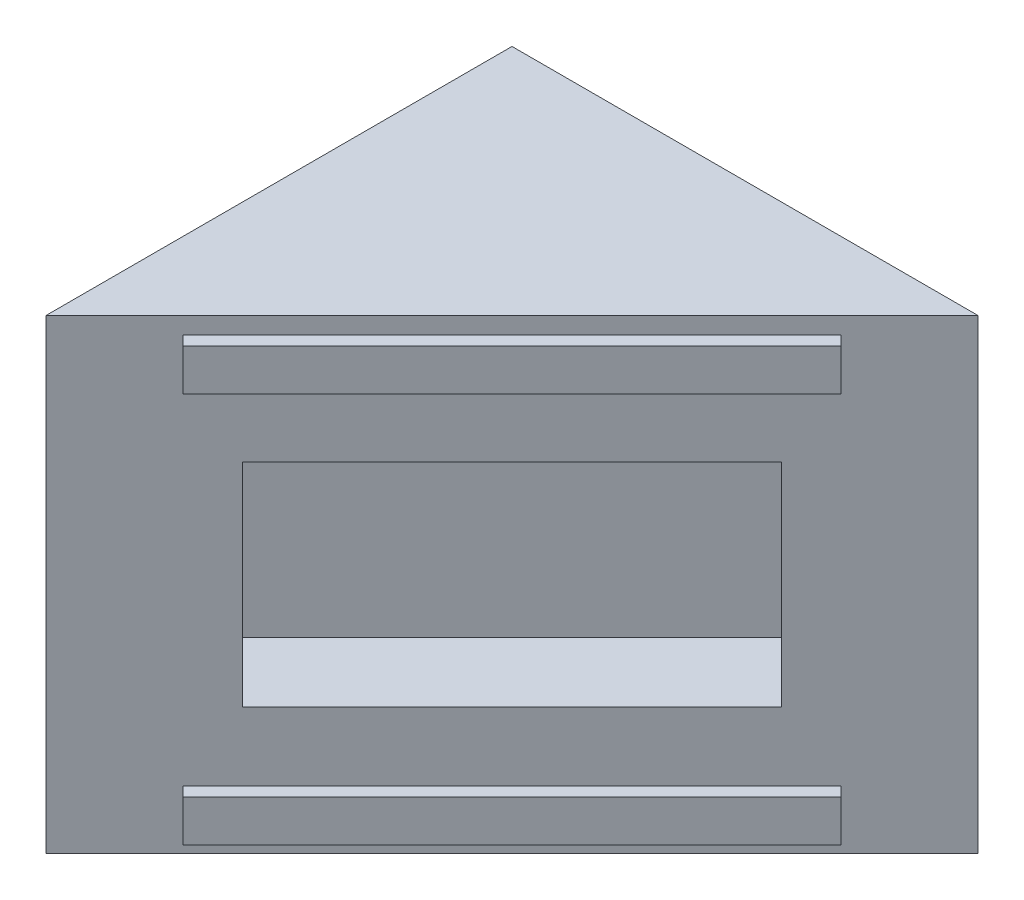
ISO-10303-21;
HEADER;
FILE_DESCRIPTION(('STEP AP214'),'2;1');
FILE_NAME('part.step','',(''),(''),'','','');
FILE_SCHEMA(('AUTOMOTIVE_DESIGN { 1 0 10303 214 1 1 1 1 }'));
ENDSEC;
DATA;
#1=APPLICATION_CONTEXT('core data for automotive mechanical design processes');
#2=APPLICATION_PROTOCOL_DEFINITION('international standard','automotive_design',2000,#1);
#3=PRODUCT_CONTEXT('',#1,'mechanical');
#4=PRODUCT('Part','Part','',(#3));
#5=PRODUCT_RELATED_PRODUCT_CATEGORY('part','',(#4));
#6=PRODUCT_DEFINITION_FORMATION('','',#4);
#7=PRODUCT_DEFINITION_CONTEXT('part definition',#1,'design');
#8=PRODUCT_DEFINITION('design','',#6,#7);
#9=PRODUCT_DEFINITION_SHAPE('','',#8);
#10=(LENGTH_UNIT() NAMED_UNIT(*) SI_UNIT(.MILLI.,.METRE.));
#11=(NAMED_UNIT(*) PLANE_ANGLE_UNIT() SI_UNIT($,.RADIAN.));
#12=(NAMED_UNIT(*) SI_UNIT($,.STERADIAN.) SOLID_ANGLE_UNIT());
#13=UNCERTAINTY_MEASURE_WITH_UNIT(LENGTH_MEASURE(1.E-05),#10,'distance_accuracy_value','');
#14=(GEOMETRIC_REPRESENTATION_CONTEXT(3) GLOBAL_UNCERTAINTY_ASSIGNED_CONTEXT((#13)) GLOBAL_UNIT_ASSIGNED_CONTEXT((#10,
#11,#12)) REPRESENTATION_CONTEXT('',''));
#15=CARTESIAN_POINT('',(0.,0.,0.));
#16=DIRECTION('',(0.,0.,1.));
#17=DIRECTION('',(1.,0.,0.));
#18=AXIS2_PLACEMENT_3D('',#15,#16,#17);
#19=CARTESIAN_POINT('',(0.,0.,0.));
#20=DIRECTION('',(0.707106781186547,0.,0.707106781186548));
#21=DIRECTION('',(0.707106781186548,0.,-0.707106781186547));
#22=AXIS2_PLACEMENT_3D('',#19,#20,#21);
#23=PLANE('',#22);
#24=DIRECTION('',(0.,1.,0.));
#25=VECTOR('',#24,1.);
#26=CARTESIAN_POINT('',(55.1305762724056,19.05,-55.1305762724056));
#27=LINE('',#26,#25);
#28=CARTESIAN_POINT('',(55.1305762724056,19.05,-55.1305762724056));
#29=VERTEX_POINT('',#28);
#30=CARTESIAN_POINT('',(55.1305762724056,50.8,-55.1305762724056));
#31=VERTEX_POINT('',#30);
#32=EDGE_CURVE('E59',#29,#31,#27,.T.);
#33=ORIENTED_EDGE('',*,*,#32,.F.);
#34=DIRECTION('',(0.707106781186547,0.,-0.707106781186548));
#35=VECTOR('',#34,1.);
#36=CARTESIAN_POINT('',(14.7194237275944,19.05,-14.7194237275944));
#37=LINE('',#36,#35);
#38=CARTESIAN_POINT('',(14.7194237275944,19.05,-14.7194237275944));
#39=VERTEX_POINT('',#38);
#40=EDGE_CURVE('E174',#39,#29,#37,.T.);
#41=ORIENTED_EDGE('',*,*,#40,.F.);
#42=DIRECTION('',(0.,-1.,0.));
#43=VECTOR('',#42,1.);
#44=CARTESIAN_POINT('',(14.7194237275944,19.05,-14.7194237275944));
#45=LINE('',#44,#43);
#46=CARTESIAN_POINT('',(14.7194237275944,50.8,-14.7194237275944));
#47=VERTEX_POINT('',#46);
#48=EDGE_CURVE('E178',#47,#39,#45,.T.);
#49=ORIENTED_EDGE('',*,*,#48,.F.);
#50=DIRECTION('',(-0.707106781186547,0.,0.707106781186548));
#51=VECTOR('',#50,1.);
#52=CARTESIAN_POINT('',(14.7194237275944,50.8,-14.7194237275944));
#53=LINE('',#52,#51);
#54=EDGE_CURVE('E187',#31,#47,#53,.T.);
#55=ORIENTED_EDGE('',*,*,#54,.F.);
#56=EDGE_LOOP('',(#33,#41,#49,#55));
#57=FACE_BOUND('',#56,.T.);
#58=DIRECTION('',(-0.707106781186548,0.,0.707106781186547));
#59=VECTOR('',#58,1.);
#60=CARTESIAN_POINT('',(34.925,69.85,-34.925));
#61=LINE('',#60,#59);
#62=CARTESIAN_POINT('',(69.85,69.85,-69.85));
#63=VERTEX_POINT('',#62);
#64=CARTESIAN_POINT('',(0.,69.85,0.));
#65=VERTEX_POINT('',#64);
#66=EDGE_CURVE('E281',#63,#65,#61,.T.);
#67=ORIENTED_EDGE('',*,*,#66,.T.);
#68=DIRECTION('',(0.,-1.,0.));
#69=VECTOR('',#68,1.);
#70=CARTESIAN_POINT('',(0.,69.85,0.));
#71=LINE('',#70,#69);
#72=CARTESIAN_POINT('',(0.,0.,0.));
#73=VERTEX_POINT('',#72);
#74=EDGE_CURVE('E11',#65,#73,#71,.T.);
#75=ORIENTED_EDGE('',*,*,#74,.T.);
#76=DIRECTION('',(0.707106781186548,0.,-0.707106781186547));
#77=VECTOR('',#76,1.);
#78=CARTESIAN_POINT('',(69.85,0.,-69.85));
#79=LINE('',#78,#77);
#80=CARTESIAN_POINT('',(69.85,0.,-69.85));
#81=VERTEX_POINT('',#80);
#82=EDGE_CURVE('E284',#73,#81,#79,.T.);
#83=ORIENTED_EDGE('',*,*,#82,.T.);
#84=DIRECTION('',(0.,-1.,0.));
#85=VECTOR('',#84,1.);
#86=CARTESIAN_POINT('',(69.85,69.85,-69.85));
#87=LINE('',#86,#85);
#88=EDGE_CURVE('E52',#63,#81,#87,.T.);
#89=ORIENTED_EDGE('',*,*,#88,.F.);
#90=EDGE_LOOP('',(#67,#75,#83,#89));
#91=FACE_BOUND('',#90,.T.);
#92=DIRECTION('',(0.707106781186547,0.,-0.707106781186548));
#93=VECTOR('',#92,1.);
#94=CARTESIAN_POINT('',(10.2741969476652,61.087,-10.2741969476652));
#95=LINE('',#94,#93);
#96=CARTESIAN_POINT('',(10.2741969476652,61.087,-10.2741969476652));
#97=VERTEX_POINT('',#96);
#98=CARTESIAN_POINT('',(59.5758030523348,61.087,-59.5758030523348));
#99=VERTEX_POINT('',#98);
#100=EDGE_CURVE('E259',#97,#99,#95,.T.);
#101=ORIENTED_EDGE('',*,*,#100,.F.);
#102=DIRECTION('',(0.,-1.,0.));
#103=VECTOR('',#102,1.);
#104=CARTESIAN_POINT('',(10.2741969476652,67.31,-10.2741969476652));
#105=LINE('',#104,#103);
#106=CARTESIAN_POINT('',(10.2741969476652,67.31,-10.2741969476652));
#107=VERTEX_POINT('',#106);
#108=EDGE_CURVE('E229',#107,#97,#105,.T.);
#109=ORIENTED_EDGE('',*,*,#108,.F.);
#110=DIRECTION('',(-0.707106781186547,0.,0.707106781186548));
#111=VECTOR('',#110,1.);
#112=CARTESIAN_POINT('',(10.2741969476652,67.31,-10.2741969476652));
#113=LINE('',#112,#111);
#114=CARTESIAN_POINT('',(59.5758030523348,67.31,-59.5758030523348));
#115=VERTEX_POINT('',#114);
#116=EDGE_CURVE('E246',#115,#107,#113,.T.);
#117=ORIENTED_EDGE('',*,*,#116,.F.);
#118=DIRECTION('',(0.,1.,0.));
#119=VECTOR('',#118,1.);
#120=CARTESIAN_POINT('',(59.5758030523348,67.31,-59.5758030523348));
#121=LINE('',#120,#119);
#122=EDGE_CURVE('E262',#99,#115,#121,.T.);
#123=ORIENTED_EDGE('',*,*,#122,.F.);
#124=EDGE_LOOP('',(#101,#109,#117,#123));
#125=FACE_BOUND('',#124,.T.);
#126=DIRECTION('',(0.707106781186547,0.,-0.707106781186548));
#127=VECTOR('',#126,1.);
#128=CARTESIAN_POINT('',(10.2741969476652,2.54,-10.2741969476652));
#129=LINE('',#128,#127);
#130=CARTESIAN_POINT('',(10.2741969476652,2.54,-10.2741969476652));
#131=VERTEX_POINT('',#130);
#132=CARTESIAN_POINT('',(59.5758030523348,2.54,-59.5758030523348));
#133=VERTEX_POINT('',#132);
#134=EDGE_CURVE('E222',#131,#133,#129,.T.);
#135=ORIENTED_EDGE('',*,*,#134,.F.);
#136=DIRECTION('',(0.,-1.,0.));
#137=VECTOR('',#136,1.);
#138=CARTESIAN_POINT('',(10.2741969476652,8.763,-10.2741969476652));
#139=LINE('',#138,#137);
#140=CARTESIAN_POINT('',(10.2741969476652,8.763,-10.2741969476652));
#141=VERTEX_POINT('',#140);
#142=EDGE_CURVE('E225',#141,#131,#139,.T.);
#143=ORIENTED_EDGE('',*,*,#142,.F.);
#144=DIRECTION('',(-0.707106781186547,0.,0.707106781186548));
#145=VECTOR('',#144,1.);
#146=CARTESIAN_POINT('',(10.2741969476652,8.763,-10.2741969476652));
#147=LINE('',#146,#145);
#148=CARTESIAN_POINT('',(59.5758030523348,8.763,-59.5758030523348));
#149=VERTEX_POINT('',#148);
#150=EDGE_CURVE('E215',#149,#141,#147,.T.);
#151=ORIENTED_EDGE('',*,*,#150,.F.);
#152=DIRECTION('',(0.,1.,0.));
#153=VECTOR('',#152,1.);
#154=CARTESIAN_POINT('',(59.5758030523348,8.763,-59.5758030523348));
#155=LINE('',#154,#153);
#156=EDGE_CURVE('E218',#133,#149,#155,.T.);
#157=ORIENTED_EDGE('',*,*,#156,.F.);
#158=EDGE_LOOP('',(#135,#143,#151,#157));
#159=FACE_BOUND('',#158,.T.);
#160=ADVANCED_FACE('F43',(#57,#91,#125,#159),#23,.T.);
#161=CARTESIAN_POINT('',(0.,69.85,0.));
#162=DIRECTION('',(0.,-1.,0.));
#163=DIRECTION('',(0.,0.,-1.));
#164=AXIS2_PLACEMENT_3D('',#161,#162,#163);
#165=PLANE('',#164);
#166=ORIENTED_EDGE('',*,*,#66,.F.);
#167=DIRECTION('',(-1.,0.,0.));
#168=VECTOR('',#167,1.);
#169=CARTESIAN_POINT('',(0.,69.85,-69.85));
#170=LINE('',#169,#168);
#171=CARTESIAN_POINT('',(0.,69.85,-69.85));
#172=VERTEX_POINT('',#171);
#173=EDGE_CURVE('E292',#63,#172,#170,.T.);
#174=ORIENTED_EDGE('',*,*,#173,.T.);
#175=DIRECTION('',(0.,0.,1.));
#176=VECTOR('',#175,1.);
#177=CARTESIAN_POINT('',(0.,69.85,0.));
#178=LINE('',#177,#176);
#179=EDGE_CURVE('E288',#172,#65,#178,.T.);
#180=ORIENTED_EDGE('',*,*,#179,.T.);
#181=EDGE_LOOP('',(#166,#174,#180));
#182=FACE_BOUND('',#181,.T.);
#183=ADVANCED_FACE('F321',(#182),#165,.F.);
#184=CARTESIAN_POINT('',(0.,0.,0.));
#185=DIRECTION('',(0.,-1.,0.));
#186=DIRECTION('',(0.,0.,-1.));
#187=AXIS2_PLACEMENT_3D('',#184,#185,#186);
#188=PLANE('',#187);
#189=DIRECTION('',(-1.,0.,0.));
#190=VECTOR('',#189,1.);
#191=CARTESIAN_POINT('',(0.,0.,-69.85));
#192=LINE('',#191,#190);
#193=CARTESIAN_POINT('',(0.,0.,-69.85));
#194=VERTEX_POINT('',#193);
#195=EDGE_CURVE('E293',#81,#194,#192,.T.);
#196=ORIENTED_EDGE('',*,*,#195,.F.);
#197=ORIENTED_EDGE('',*,*,#82,.F.);
#198=DIRECTION('',(0.,0.,1.));
#199=VECTOR('',#198,1.);
#200=CARTESIAN_POINT('',(0.,0.,0.));
#201=LINE('',#200,#199);
#202=EDGE_CURVE('E287',#194,#73,#201,.T.);
#203=ORIENTED_EDGE('',*,*,#202,.F.);
#204=EDGE_LOOP('',(#196,#197,#203));
#205=FACE_BOUND('',#204,.T.);
#206=ADVANCED_FACE('F316',(#205),#188,.T.);
#207=CARTESIAN_POINT('',(0.,69.85,0.));
#208=DIRECTION('',(1.,0.,0.));
#209=DIRECTION('',(0.,0.,-1.));
#210=AXIS2_PLACEMENT_3D('',#207,#208,#209);
#211=PLANE('',#210);
#212=ORIENTED_EDGE('',*,*,#202,.T.);
#213=ORIENTED_EDGE('',*,*,#74,.F.);
#214=ORIENTED_EDGE('',*,*,#179,.F.);
#215=DIRECTION('',(0.,-1.,0.));
#216=VECTOR('',#215,1.);
#217=CARTESIAN_POINT('',(0.,69.85,-69.85));
#218=LINE('',#217,#216);
#219=EDGE_CURVE('E296',#172,#194,#218,.T.);
#220=ORIENTED_EDGE('',*,*,#219,.T.);
#221=EDGE_LOOP('',(#212,#213,#214,#220));
#222=FACE_BOUND('',#221,.T.);
#223=ADVANCED_FACE('F45',(#222),#211,.F.);
#224=CARTESIAN_POINT('',(0.,69.85,-69.85));
#225=DIRECTION('',(0.,0.,1.));
#226=DIRECTION('',(1.,0.,0.));
#227=AXIS2_PLACEMENT_3D('',#224,#225,#226);
#228=PLANE('',#227);
#229=ORIENTED_EDGE('',*,*,#195,.T.);
#230=ORIENTED_EDGE('',*,*,#219,.F.);
#231=ORIENTED_EDGE('',*,*,#173,.F.);
#232=ORIENTED_EDGE('',*,*,#88,.T.);
#233=EDGE_LOOP('',(#229,#230,#231,#232));
#234=FACE_BOUND('',#233,.T.);
#235=ADVANCED_FACE('F309',(#234),#228,.F.);
#236=CARTESIAN_POINT('',(11.7110379270362,67.31,-8.83735596829409));
#237=DIRECTION('',(0.707106781186547,0.,-0.707106781186548));
#238=DIRECTION('',(-0.707106781186548,0.,-0.707106781186547));
#239=AXIS2_PLACEMENT_3D('',#236,#237,#238);
#240=PLANE('',#239);
#241=ORIENTED_EDGE('',*,*,#108,.T.);
#242=DIRECTION('',(-0.707106781186548,0.,-0.707106781186547));
#243=VECTOR('',#242,1.);
#244=CARTESIAN_POINT('',(11.7110379270362,61.087,-8.83735596829411));
#245=LINE('',#244,#243);
#246=CARTESIAN_POINT('',(11.7110379270362,61.087,-8.83735596829411));
#247=VERTEX_POINT('',#246);
#248=EDGE_CURVE('E278',#247,#97,#245,.T.);
#249=ORIENTED_EDGE('',*,*,#248,.F.);
#250=DIRECTION('',(0.,-1.,0.));
#251=VECTOR('',#250,1.);
#252=CARTESIAN_POINT('',(11.7110379270362,67.31,-8.83735596829409));
#253=LINE('',#252,#251);
#254=CARTESIAN_POINT('',(11.7110379270362,67.31,-8.83735596829409));
#255=VERTEX_POINT('',#254);
#256=EDGE_CURVE('E241',#255,#247,#253,.T.);
#257=ORIENTED_EDGE('',*,*,#256,.F.);
#258=DIRECTION('',(-0.707106781186548,0.,-0.707106781186547));
#259=VECTOR('',#258,1.);
#260=CARTESIAN_POINT('',(11.7110379270362,67.31,-8.83735596829409));
#261=LINE('',#260,#259);
#262=EDGE_CURVE('E255',#255,#107,#261,.T.);
#263=ORIENTED_EDGE('',*,*,#262,.T.);
#264=EDGE_LOOP('',(#241,#249,#257,#263));
#265=FACE_BOUND('',#264,.T.);
#266=ADVANCED_FACE('F373',(#265),#240,.F.);
#267=CARTESIAN_POINT('',(11.7110379270362,61.087,-8.83735596829411));
#268=DIRECTION('',(0.,1.,0.));
#269=DIRECTION('',(0.,0.,1.));
#270=AXIS2_PLACEMENT_3D('',#267,#268,#269);
#271=PLANE('',#270);
#272=ORIENTED_EDGE('',*,*,#100,.T.);
#273=DIRECTION('',(-0.707106781186548,0.,-0.707106781186547));
#274=VECTOR('',#273,1.);
#275=CARTESIAN_POINT('',(61.0126440317059,61.087,-58.1389620729637));
#276=LINE('',#275,#274);
#277=CARTESIAN_POINT('',(61.0126440317059,61.087,-58.1389620729637));
#278=VERTEX_POINT('',#277);
#279=EDGE_CURVE('E274',#278,#99,#276,.T.);
#280=ORIENTED_EDGE('',*,*,#279,.F.);
#281=DIRECTION('',(0.707106781186547,0.,-0.707106781186548));
#282=VECTOR('',#281,1.);
#283=CARTESIAN_POINT('',(11.7110379270362,61.087,-8.83735596829411));
#284=LINE('',#283,#282);
#285=EDGE_CURVE('E245',#247,#278,#284,.T.);
#286=ORIENTED_EDGE('',*,*,#285,.F.);
#287=ORIENTED_EDGE('',*,*,#248,.T.);
#288=EDGE_LOOP('',(#272,#280,#286,#287));
#289=FACE_BOUND('',#288,.T.);
#290=ADVANCED_FACE('F369',(#289),#271,.F.);
#291=CARTESIAN_POINT('',(61.0126440317059,67.31,-58.1389620729638));
#292=DIRECTION('',(-0.707106781186547,0.,0.707106781186548));
#293=DIRECTION('',(0.707106781186548,0.,0.707106781186547));
#294=AXIS2_PLACEMENT_3D('',#291,#292,#293);
#295=PLANE('',#294);
#296=ORIENTED_EDGE('',*,*,#122,.T.);
#297=DIRECTION('',(-0.707106781186548,0.,-0.707106781186547));
#298=VECTOR('',#297,1.);
#299=CARTESIAN_POINT('',(61.0126440317059,67.31,-58.1389620729638));
#300=LINE('',#299,#298);
#301=CARTESIAN_POINT('',(61.0126440317059,67.31,-58.1389620729638));
#302=VERTEX_POINT('',#301);
#303=EDGE_CURVE('E271',#302,#115,#300,.T.);
#304=ORIENTED_EDGE('',*,*,#303,.F.);
#305=DIRECTION('',(0.,1.,0.));
#306=VECTOR('',#305,1.);
#307=CARTESIAN_POINT('',(61.0126440317059,67.31,-58.1389620729638));
#308=LINE('',#307,#306);
#309=EDGE_CURVE('E249',#278,#302,#308,.T.);
#310=ORIENTED_EDGE('',*,*,#309,.F.);
#311=ORIENTED_EDGE('',*,*,#279,.T.);
#312=EDGE_LOOP('',(#296,#304,#310,#311));
#313=FACE_BOUND('',#312,.T.);
#314=ADVANCED_FACE('F365',(#313),#295,.F.);
#315=CARTESIAN_POINT('',(11.7110379270362,67.31,-8.83735596829409));
#316=DIRECTION('',(0.,-1.,0.));
#317=DIRECTION('',(0.,0.,-1.));
#318=AXIS2_PLACEMENT_3D('',#315,#316,#317);
#319=PLANE('',#318);
#320=ORIENTED_EDGE('',*,*,#116,.T.);
#321=ORIENTED_EDGE('',*,*,#262,.F.);
#322=DIRECTION('',(-0.707106781186547,0.,0.707106781186548));
#323=VECTOR('',#322,1.);
#324=CARTESIAN_POINT('',(11.7110379270362,67.31,-8.83735596829409));
#325=LINE('',#324,#323);
#326=EDGE_CURVE('E252',#302,#255,#325,.T.);
#327=ORIENTED_EDGE('',*,*,#326,.F.);
#328=ORIENTED_EDGE('',*,*,#303,.T.);
#329=EDGE_LOOP('',(#320,#321,#327,#328));
#330=FACE_BOUND('',#329,.T.);
#331=ADVANCED_FACE('F361',(#330),#319,.F.);
#332=CARTESIAN_POINT('',(1.43684097937107,0.,1.43684097937106));
#333=DIRECTION('',(0.707106781186548,0.,0.707106781186547));
#334=DIRECTION('',(0.707106781186547,0.,-0.707106781186548));
#335=AXIS2_PLACEMENT_3D('',#332,#333,#334);
#336=PLANE('',#335);
#337=ORIENTED_EDGE('',*,*,#256,.T.);
#338=ORIENTED_EDGE('',*,*,#285,.T.);
#339=ORIENTED_EDGE('',*,*,#309,.T.);
#340=ORIENTED_EDGE('',*,*,#326,.T.);
#341=EDGE_LOOP('',(#337,#338,#339,#340));
#342=FACE_BOUND('',#341,.T.);
#343=ADVANCED_FACE('F358',(#342),#336,.T.);
#344=CARTESIAN_POINT('',(11.7110379270362,8.763,-8.83735596829409));
#345=DIRECTION('',(0.707106781186547,0.,-0.707106781186548));
#346=DIRECTION('',(-0.707106781186548,0.,-0.707106781186547));
#347=AXIS2_PLACEMENT_3D('',#344,#345,#346);
#348=PLANE('',#347);
#349=ORIENTED_EDGE('',*,*,#142,.T.);
#350=DIRECTION('',(-0.707106781186548,0.,-0.707106781186547));
#351=VECTOR('',#350,1.);
#352=CARTESIAN_POINT('',(11.7110379270362,2.54,-8.83735596829409));
#353=LINE('',#352,#351);
#354=CARTESIAN_POINT('',(11.7110379270362,2.54,-8.83735596829409));
#355=VERTEX_POINT('',#354);
#356=EDGE_CURVE('E196',#355,#131,#353,.T.);
#357=ORIENTED_EDGE('',*,*,#356,.F.);
#358=DIRECTION('',(0.,-1.,0.));
#359=VECTOR('',#358,1.);
#360=CARTESIAN_POINT('',(11.7110379270362,8.763,-8.83735596829409));
#361=LINE('',#360,#359);
#362=CARTESIAN_POINT('',(11.7110379270362,8.763,-8.83735596829409));
#363=VERTEX_POINT('',#362);
#364=EDGE_CURVE('E219',#363,#355,#361,.T.);
#365=ORIENTED_EDGE('',*,*,#364,.F.);
#366=DIRECTION('',(-0.707106781186548,0.,-0.707106781186547));
#367=VECTOR('',#366,1.);
#368=CARTESIAN_POINT('',(11.7110379270362,8.763,-8.83735596829409));
#369=LINE('',#368,#367);
#370=EDGE_CURVE('E210',#363,#141,#369,.T.);
#371=ORIENTED_EDGE('',*,*,#370,.T.);
#372=EDGE_LOOP('',(#349,#357,#365,#371));
#373=FACE_BOUND('',#372,.T.);
#374=ADVANCED_FACE('F346',(#373),#348,.F.);
#375=CARTESIAN_POINT('',(11.7110379270362,2.54,-8.83735596829409));
#376=DIRECTION('',(0.,1.,0.));
#377=DIRECTION('',(0.,0.,1.));
#378=AXIS2_PLACEMENT_3D('',#375,#376,#377);
#379=PLANE('',#378);
#380=ORIENTED_EDGE('',*,*,#134,.T.);
#381=DIRECTION('',(-0.707106781186548,0.,-0.707106781186547));
#382=VECTOR('',#381,1.);
#383=CARTESIAN_POINT('',(61.0126440317059,2.54,-58.1389620729638));
#384=LINE('',#383,#382);
#385=CARTESIAN_POINT('',(61.0126440317059,2.54,-58.1389620729638));
#386=VERTEX_POINT('',#385);
#387=EDGE_CURVE('E204',#386,#133,#384,.T.);
#388=ORIENTED_EDGE('',*,*,#387,.F.);
#389=DIRECTION('',(0.707106781186547,0.,-0.707106781186548));
#390=VECTOR('',#389,1.);
#391=CARTESIAN_POINT('',(11.7110379270362,2.54,-8.83735596829409));
#392=LINE('',#391,#390);
#393=EDGE_CURVE('E235',#355,#386,#392,.T.);
#394=ORIENTED_EDGE('',*,*,#393,.F.);
#395=ORIENTED_EDGE('',*,*,#356,.T.);
#396=EDGE_LOOP('',(#380,#388,#394,#395));
#397=FACE_BOUND('',#396,.T.);
#398=ADVANCED_FACE('F336',(#397),#379,.F.);
#399=CARTESIAN_POINT('',(61.0126440317059,8.763,-58.1389620729638));
#400=DIRECTION('',(-0.707106781186547,0.,0.707106781186548));
#401=DIRECTION('',(0.707106781186548,0.,0.707106781186547));
#402=AXIS2_PLACEMENT_3D('',#399,#400,#401);
#403=PLANE('',#402);
#404=ORIENTED_EDGE('',*,*,#156,.T.);
#405=DIRECTION('',(-0.707106781186548,0.,-0.707106781186547));
#406=VECTOR('',#405,1.);
#407=CARTESIAN_POINT('',(61.0126440317059,8.763,-58.1389620729638));
#408=LINE('',#407,#406);
#409=CARTESIAN_POINT('',(61.0126440317059,8.763,-58.1389620729638));
#410=VERTEX_POINT('',#409);
#411=EDGE_CURVE('E67',#410,#149,#408,.T.);
#412=ORIENTED_EDGE('',*,*,#411,.F.);
#413=DIRECTION('',(0.,1.,0.));
#414=VECTOR('',#413,1.);
#415=CARTESIAN_POINT('',(61.0126440317059,8.763,-58.1389620729638));
#416=LINE('',#415,#414);
#417=EDGE_CURVE('E232',#386,#410,#416,.T.);
#418=ORIENTED_EDGE('',*,*,#417,.F.);
#419=ORIENTED_EDGE('',*,*,#387,.T.);
#420=EDGE_LOOP('',(#404,#412,#418,#419));
#421=FACE_BOUND('',#420,.T.);
#422=ADVANCED_FACE('F340',(#421),#403,.F.);
#423=CARTESIAN_POINT('',(11.7110379270362,8.763,-8.83735596829409));
#424=DIRECTION('',(0.,-1.,0.));
#425=DIRECTION('',(0.,0.,-1.));
#426=AXIS2_PLACEMENT_3D('',#423,#424,#425);
#427=PLANE('',#426);
#428=ORIENTED_EDGE('',*,*,#150,.T.);
#429=ORIENTED_EDGE('',*,*,#370,.F.);
#430=DIRECTION('',(-0.707106781186547,0.,0.707106781186548));
#431=VECTOR('',#430,1.);
#432=CARTESIAN_POINT('',(11.7110379270362,8.763,-8.83735596829409));
#433=LINE('',#432,#431);
#434=EDGE_CURVE('E214',#410,#363,#433,.T.);
#435=ORIENTED_EDGE('',*,*,#434,.F.);
#436=ORIENTED_EDGE('',*,*,#411,.T.);
#437=EDGE_LOOP('',(#428,#429,#435,#436));
#438=FACE_BOUND('',#437,.T.);
#439=ADVANCED_FACE('F347',(#438),#427,.F.);
#440=CARTESIAN_POINT('',(1.43684097937106,0.,1.43684097937106));
#441=DIRECTION('',(0.707106781186548,0.,0.707106781186547));
#442=DIRECTION('',(0.707106781186547,0.,-0.707106781186548));
#443=AXIS2_PLACEMENT_3D('',#440,#441,#442);
#444=PLANE('',#443);
#445=ORIENTED_EDGE('',*,*,#364,.T.);
#446=ORIENTED_EDGE('',*,*,#393,.T.);
#447=ORIENTED_EDGE('',*,*,#417,.T.);
#448=ORIENTED_EDGE('',*,*,#434,.T.);
#449=EDGE_LOOP('',(#445,#446,#447,#448));
#450=FACE_BOUND('',#449,.T.);
#451=ADVANCED_FACE('F342',(#450),#444,.T.);
#452=CARTESIAN_POINT('',(46.1503201513364,19.05,-64.1108323934748));
#453=DIRECTION('',(0.707106781186547,0.,-0.707106781186548));
#454=DIRECTION('',(-0.707106781186548,0.,-0.707106781186547));
#455=AXIS2_PLACEMENT_3D('',#452,#453,#454);
#456=PLANE('',#455);
#457=ORIENTED_EDGE('',*,*,#32,.T.);
#458=DIRECTION('',(0.707106781186548,0.,0.707106781186547));
#459=VECTOR('',#458,1.);
#460=CARTESIAN_POINT('',(46.1503201513364,50.8,-64.1108323934748));
#461=LINE('',#460,#459);
#462=CARTESIAN_POINT('',(46.1503201513364,50.8,-64.1108323934748));
#463=VERTEX_POINT('',#462);
#464=EDGE_CURVE('E149',#463,#31,#461,.T.);
#465=ORIENTED_EDGE('',*,*,#464,.F.);
#466=DIRECTION('',(0.,1.,0.));
#467=VECTOR('',#466,1.);
#468=CARTESIAN_POINT('',(46.1503201513364,19.05,-64.1108323934748));
#469=LINE('',#468,#467);
#470=CARTESIAN_POINT('',(46.1503201513364,19.05,-64.1108323934748));
#471=VERTEX_POINT('',#470);
#472=EDGE_CURVE('E153',#471,#463,#469,.T.);
#473=ORIENTED_EDGE('',*,*,#472,.F.);
#474=DIRECTION('',(0.707106781186548,0.,0.707106781186547));
#475=VECTOR('',#474,1.);
#476=CARTESIAN_POINT('',(46.1503201513364,19.05,-64.1108323934748));
#477=LINE('',#476,#475);
#478=EDGE_CURVE('E193',#471,#29,#477,.T.);
#479=ORIENTED_EDGE('',*,*,#478,.T.);
#480=EDGE_LOOP('',(#457,#465,#473,#479));
#481=FACE_BOUND('',#480,.T.);
#482=ADVANCED_FACE('F151',(#481),#456,.F.);
#483=CARTESIAN_POINT('',(5.73916760652524,19.05,-23.6996798486636));
#484=DIRECTION('',(0.,-1.,0.));
#485=DIRECTION('',(0.,0.,-1.));
#486=AXIS2_PLACEMENT_3D('',#483,#484,#485);
#487=PLANE('',#486);
#488=ORIENTED_EDGE('',*,*,#40,.T.);
#489=ORIENTED_EDGE('',*,*,#478,.F.);
#490=DIRECTION('',(0.707106781186547,0.,-0.707106781186548));
#491=VECTOR('',#490,1.);
#492=CARTESIAN_POINT('',(5.73916760652524,19.05,-23.6996798486636));
#493=LINE('',#492,#491);
#494=CARTESIAN_POINT('',(5.73916760652524,19.05,-23.6996798486636));
#495=VERTEX_POINT('',#494);
#496=EDGE_CURVE('E160',#495,#471,#493,.T.);
#497=ORIENTED_EDGE('',*,*,#496,.F.);
#498=DIRECTION('',(0.707106781186548,0.,0.707106781186547));
#499=VECTOR('',#498,1.);
#500=CARTESIAN_POINT('',(5.73916760652524,19.05,-23.6996798486636));
#501=LINE('',#500,#499);
#502=EDGE_CURVE('E197',#495,#39,#501,.T.);
#503=ORIENTED_EDGE('',*,*,#502,.T.);
#504=EDGE_LOOP('',(#488,#489,#497,#503));
#505=FACE_BOUND('',#504,.T.);
#506=ADVANCED_FACE('F414',(#505),#487,.F.);
#507=CARTESIAN_POINT('',(5.73916760652524,19.05,-23.6996798486636));
#508=DIRECTION('',(-0.707106781186547,0.,0.707106781186548));
#509=DIRECTION('',(0.707106781186548,0.,0.707106781186547));
#510=AXIS2_PLACEMENT_3D('',#507,#508,#509);
#511=PLANE('',#510);
#512=ORIENTED_EDGE('',*,*,#48,.T.);
#513=ORIENTED_EDGE('',*,*,#502,.F.);
#514=DIRECTION('',(0.,-1.,0.));
#515=VECTOR('',#514,1.);
#516=CARTESIAN_POINT('',(5.73916760652524,19.05,-23.6996798486636));
#517=LINE('',#516,#515);
#518=CARTESIAN_POINT('',(5.73916760652524,50.8,-23.6996798486636));
#519=VERTEX_POINT('',#518);
#520=EDGE_CURVE('E169',#519,#495,#517,.T.);
#521=ORIENTED_EDGE('',*,*,#520,.F.);
#522=DIRECTION('',(0.707106781186548,0.,0.707106781186547));
#523=VECTOR('',#522,1.);
#524=CARTESIAN_POINT('',(5.73916760652524,50.8,-23.6996798486636));
#525=LINE('',#524,#523);
#526=EDGE_CURVE('E159',#519,#47,#525,.T.);
#527=ORIENTED_EDGE('',*,*,#526,.T.);
#528=EDGE_LOOP('',(#512,#513,#521,#527));
#529=FACE_BOUND('',#528,.T.);
#530=ADVANCED_FACE('F424',(#529),#511,.F.);
#531=CARTESIAN_POINT('',(5.73916760652524,50.8,-23.6996798486636));
#532=DIRECTION('',(0.,1.,0.));
#533=DIRECTION('',(0.,0.,1.));
#534=AXIS2_PLACEMENT_3D('',#531,#532,#533);
#535=PLANE('',#534);
#536=ORIENTED_EDGE('',*,*,#54,.T.);
#537=ORIENTED_EDGE('',*,*,#526,.F.);
#538=DIRECTION('',(-0.707106781186547,0.,0.707106781186548));
#539=VECTOR('',#538,1.);
#540=CARTESIAN_POINT('',(5.73916760652524,50.8,-23.6996798486636));
#541=LINE('',#540,#539);
#542=EDGE_CURVE('E163',#463,#519,#541,.T.);
#543=ORIENTED_EDGE('',*,*,#542,.F.);
#544=ORIENTED_EDGE('',*,*,#464,.T.);
#545=EDGE_LOOP('',(#536,#537,#543,#544));
#546=FACE_BOUND('',#545,.T.);
#547=ADVANCED_FACE('F164',(#546),#535,.F.);
#548=CARTESIAN_POINT('',(-8.98025612106916,0.,-8.98025612106915));
#549=DIRECTION('',(-0.707106781186548,0.,-0.707106781186547));
#550=DIRECTION('',(-0.707106781186547,0.,0.707106781186548));
#551=AXIS2_PLACEMENT_3D('',#548,#549,#550);
#552=PLANE('',#551);
#553=ORIENTED_EDGE('',*,*,#472,.T.);
#554=ORIENTED_EDGE('',*,*,#542,.T.);
#555=ORIENTED_EDGE('',*,*,#520,.T.);
#556=ORIENTED_EDGE('',*,*,#496,.T.);
#557=EDGE_LOOP('',(#553,#554,#555,#556));
#558=FACE_BOUND('',#557,.T.);
#559=ADVANCED_FACE('F171',(#558),#552,.F.);
#560=CLOSED_SHELL('',(#160,#183,#206,#223,#235,#266,#290,#314,#331,#343,#374,#398,#422,#439,
#451,#482,#506,#530,#547,#559));
#561=MANIFOLD_SOLID_BREP('B2',#560);
#562=ADVANCED_BREP_SHAPE_REPRESENTATION('',(#18,#561),#14);
#563=SHAPE_DEFINITION_REPRESENTATION(#9,#562);
ENDSEC;
END-ISO-10303-21;
